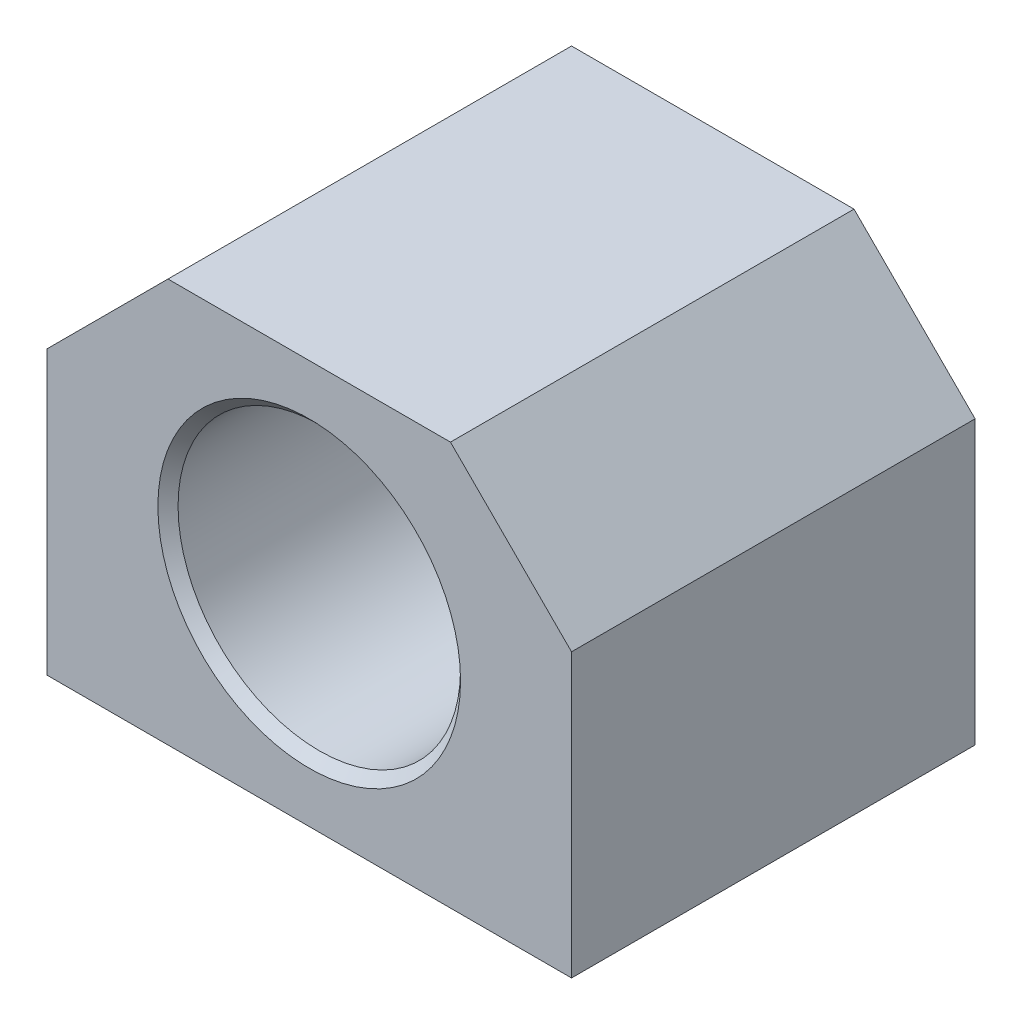
ISO-10303-21;
HEADER;
FILE_DESCRIPTION(('STEP AP214'),'2;1');
FILE_NAME('part.step','',(''),(''),'','','');
FILE_SCHEMA(('AUTOMOTIVE_DESIGN { 1 0 10303 214 1 1 1 1 }'));
ENDSEC;
DATA;
#1=APPLICATION_CONTEXT('core data for automotive mechanical design processes');
#2=APPLICATION_PROTOCOL_DEFINITION('international standard','automotive_design',2000,#1);
#3=PRODUCT_CONTEXT('',#1,'mechanical');
#4=PRODUCT('Part','Part','',(#3));
#5=PRODUCT_RELATED_PRODUCT_CATEGORY('part','',(#4));
#6=PRODUCT_DEFINITION_FORMATION('','',#4);
#7=PRODUCT_DEFINITION_CONTEXT('part definition',#1,'design');
#8=PRODUCT_DEFINITION('design','',#6,#7);
#9=PRODUCT_DEFINITION_SHAPE('','',#8);
#10=(LENGTH_UNIT() NAMED_UNIT(*) SI_UNIT(.MILLI.,.METRE.));
#11=(NAMED_UNIT(*) PLANE_ANGLE_UNIT() SI_UNIT($,.RADIAN.));
#12=(NAMED_UNIT(*) SI_UNIT($,.STERADIAN.) SOLID_ANGLE_UNIT());
#13=UNCERTAINTY_MEASURE_WITH_UNIT(LENGTH_MEASURE(1.E-05),#10,'distance_accuracy_value','');
#14=(GEOMETRIC_REPRESENTATION_CONTEXT(3) GLOBAL_UNCERTAINTY_ASSIGNED_CONTEXT((#13)) GLOBAL_UNIT_ASSIGNED_CONTEXT((#10,
#11,#12)) REPRESENTATION_CONTEXT('',''));
#15=CARTESIAN_POINT('',(0.,0.,0.));
#16=DIRECTION('',(0.,0.,1.));
#17=DIRECTION('',(1.,0.,0.));
#18=AXIS2_PLACEMENT_3D('',#15,#16,#17);
#19=CARTESIAN_POINT('',(14.103692308,-18.722756464,8.));
#20=DIRECTION('',(0.,-1.,0.));
#21=DIRECTION('',(0.,0.,-1.));
#22=AXIS2_PLACEMENT_3D('',#19,#20,#21);
#23=CONICAL_SURFACE('',#22,0.,0.785398163397448);
#24=CARTESIAN_POINT('',(14.103692308,-18.722756464,8.));
#25=VERTEX_POINT('',#24);
#26=VERTEX_LOOP('',#25);
#27=FACE_BOUND('',#26,.T.);
#28=CARTESIAN_POINT('',(14.103692308,-20.8227564635711,8.));
#29=DIRECTION('',(0.,-1.,0.));
#30=DIRECTION('',(0.,0.,-1.));
#31=AXIS2_PLACEMENT_3D('',#28,#29,#30);
#32=CIRCLE('',#31,2.1);
#33=CARTESIAN_POINT('',(14.103692308,-20.8227564635711,5.9));
#34=VERTEX_POINT('',#33);
#35=EDGE_CURVE('E103',#34,#34,#32,.F.);
#36=ORIENTED_EDGE('',*,*,#35,.F.);
#37=EDGE_LOOP('',(#36));
#38=FACE_BOUND('',#37,.T.);
#39=ADVANCED_FACE('F17',(#27,#38),#23,.F.);
#40=CARTESIAN_POINT('',(14.103692308,-18.722756464,32.));
#41=DIRECTION('',(0.,-1.,0.));
#42=DIRECTION('',(0.,0.,-1.));
#43=AXIS2_PLACEMENT_3D('',#40,#41,#42);
#44=CONICAL_SURFACE('',#43,0.,0.785398163397448);
#45=CARTESIAN_POINT('',(14.103692308,-18.722756464,32.));
#46=VERTEX_POINT('',#45);
#47=VERTEX_LOOP('',#46);
#48=FACE_BOUND('',#47,.T.);
#49=CARTESIAN_POINT('',(14.103692308,-20.8227564635711,32.));
#50=DIRECTION('',(0.,-1.,0.));
#51=DIRECTION('',(0.,0.,-1.));
#52=AXIS2_PLACEMENT_3D('',#49,#50,#51);
#53=CIRCLE('',#52,2.1);
#54=CARTESIAN_POINT('',(14.103692308,-20.8227564635711,29.9));
#55=VERTEX_POINT('',#54);
#56=EDGE_CURVE('E106',#55,#55,#53,.F.);
#57=ORIENTED_EDGE('',*,*,#56,.F.);
#58=EDGE_LOOP('',(#57));
#59=FACE_BOUND('',#58,.T.);
#60=ADVANCED_FACE('F100',(#48,#59),#44,.F.);
#61=CARTESIAN_POINT('',(-25.896307692,-18.722756464,32.));
#62=DIRECTION('',(0.,-1.,0.));
#63=DIRECTION('',(0.,0.,-1.));
#64=AXIS2_PLACEMENT_3D('',#61,#62,#63);
#65=CONICAL_SURFACE('',#64,0.,0.785398163397448);
#66=CARTESIAN_POINT('',(-25.896307692,-18.722756464,32.));
#67=VERTEX_POINT('',#66);
#68=VERTEX_LOOP('',#67);
#69=FACE_BOUND('',#68,.T.);
#70=CARTESIAN_POINT('',(-25.896307692,-20.8227564635711,32.));
#71=DIRECTION('',(0.,-1.,0.));
#72=DIRECTION('',(0.,0.,-1.));
#73=AXIS2_PLACEMENT_3D('',#70,#71,#72);
#74=CIRCLE('',#73,2.1);
#75=CARTESIAN_POINT('',(-25.896307692,-20.8227564635711,29.9));
#76=VERTEX_POINT('',#75);
#77=EDGE_CURVE('E111',#76,#76,#74,.F.);
#78=ORIENTED_EDGE('',*,*,#77,.F.);
#79=EDGE_LOOP('',(#78));
#80=FACE_BOUND('',#79,.T.);
#81=ADVANCED_FACE('F255',(#69,#80),#65,.F.);
#82=CARTESIAN_POINT('',(-25.896307692,-18.722756464,8.));
#83=DIRECTION('',(0.,-1.,0.));
#84=DIRECTION('',(0.,0.,-1.));
#85=AXIS2_PLACEMENT_3D('',#82,#83,#84);
#86=CONICAL_SURFACE('',#85,0.,0.785398163397448);
#87=CARTESIAN_POINT('',(-25.896307692,-18.722756464,8.));
#88=VERTEX_POINT('',#87);
#89=VERTEX_LOOP('',#88);
#90=FACE_BOUND('',#89,.T.);
#91=CARTESIAN_POINT('',(-25.896307692,-20.8227564635711,8.));
#92=DIRECTION('',(0.,-1.,0.));
#93=DIRECTION('',(0.,0.,-1.));
#94=AXIS2_PLACEMENT_3D('',#91,#92,#93);
#95=CIRCLE('',#94,2.1);
#96=CARTESIAN_POINT('',(-25.896307692,-20.8227564635711,5.9));
#97=VERTEX_POINT('',#96);
#98=EDGE_CURVE('E246',#97,#97,#95,.F.);
#99=ORIENTED_EDGE('',*,*,#98,.F.);
#100=EDGE_LOOP('',(#99));
#101=FACE_BOUND('',#100,.T.);
#102=ADVANCED_FACE('F257',(#90,#101),#86,.F.);
#103=CARTESIAN_POINT('',(14.103692308,-20.822756464,8.));
#104=DIRECTION('',(0.,-1.,0.));
#105=DIRECTION('',(0.,0.,-1.));
#106=AXIS2_PLACEMENT_3D('',#103,#104,#105);
#107=CYLINDRICAL_SURFACE('',#106,2.1);
#108=CARTESIAN_POINT('',(14.103692308,-32.3977564635746,8.));
#109=DIRECTION('',(0.,-1.,0.));
#110=DIRECTION('',(0.,0.,-1.));
#111=AXIS2_PLACEMENT_3D('',#108,#109,#110);
#112=CIRCLE('',#111,2.09999999957459);
#113=CARTESIAN_POINT('',(14.103692308,-32.3977564635746,5.90000000042541));
#114=VERTEX_POINT('',#113);
#115=EDGE_CURVE('E242',#114,#114,#112,.F.);
#116=ORIENTED_EDGE('',*,*,#115,.F.);
#117=EDGE_LOOP('',(#116));
#118=FACE_BOUND('',#117,.T.);
#119=ORIENTED_EDGE('',*,*,#35,.T.);
#120=EDGE_LOOP('',(#119));
#121=FACE_BOUND('',#120,.T.);
#122=ADVANCED_FACE('F265',(#118,#121),#107,.F.);
#123=CARTESIAN_POINT('',(14.103692308,-20.822756464,32.));
#124=DIRECTION('',(0.,-1.,0.));
#125=DIRECTION('',(0.,0.,-1.));
#126=AXIS2_PLACEMENT_3D('',#123,#124,#125);
#127=CYLINDRICAL_SURFACE('',#126,2.1);
#128=CARTESIAN_POINT('',(14.103692308,-32.3977564635746,32.));
#129=DIRECTION('',(0.,-1.,0.));
#130=DIRECTION('',(0.,0.,-1.));
#131=AXIS2_PLACEMENT_3D('',#128,#129,#130);
#132=CIRCLE('',#131,2.09999999957461);
#133=CARTESIAN_POINT('',(14.103692308,-32.3977564635746,29.9000000004254));
#134=VERTEX_POINT('',#133);
#135=EDGE_CURVE('E238',#134,#134,#132,.F.);
#136=ORIENTED_EDGE('',*,*,#135,.F.);
#137=EDGE_LOOP('',(#136));
#138=FACE_BOUND('',#137,.T.);
#139=ORIENTED_EDGE('',*,*,#56,.T.);
#140=EDGE_LOOP('',(#139));
#141=FACE_BOUND('',#140,.T.);
#142=ADVANCED_FACE('F409',(#138,#141),#127,.F.);
#143=CARTESIAN_POINT('',(-25.896307692,-20.822756464,32.));
#144=DIRECTION('',(0.,-1.,0.));
#145=DIRECTION('',(0.,0.,-1.));
#146=AXIS2_PLACEMENT_3D('',#143,#144,#145);
#147=CYLINDRICAL_SURFACE('',#146,2.1);
#148=CARTESIAN_POINT('',(-25.896307692,-32.3977564635746,32.));
#149=DIRECTION('',(0.,-1.,0.));
#150=DIRECTION('',(0.,0.,-1.));
#151=AXIS2_PLACEMENT_3D('',#148,#149,#150);
#152=CIRCLE('',#151,2.09999999957461);
#153=CARTESIAN_POINT('',(-25.896307692,-32.3977564635746,29.9000000004254));
#154=VERTEX_POINT('',#153);
#155=EDGE_CURVE('E234',#154,#154,#152,.F.);
#156=ORIENTED_EDGE('',*,*,#155,.F.);
#157=EDGE_LOOP('',(#156));
#158=FACE_BOUND('',#157,.T.);
#159=ORIENTED_EDGE('',*,*,#77,.T.);
#160=EDGE_LOOP('',(#159));
#161=FACE_BOUND('',#160,.T.);
#162=ADVANCED_FACE('F253',(#158,#161),#147,.F.);
#163=CARTESIAN_POINT('',(-25.896307692,-20.822756464,8.));
#164=DIRECTION('',(0.,-1.,0.));
#165=DIRECTION('',(0.,0.,-1.));
#166=AXIS2_PLACEMENT_3D('',#163,#164,#165);
#167=CYLINDRICAL_SURFACE('',#166,2.1);
#168=CARTESIAN_POINT('',(-25.896307692,-32.3977564635746,8.));
#169=DIRECTION('',(0.,-1.,0.));
#170=DIRECTION('',(0.,0.,-1.));
#171=AXIS2_PLACEMENT_3D('',#168,#169,#170);
#172=CIRCLE('',#171,2.09999999957461);
#173=CARTESIAN_POINT('',(-25.896307692,-32.3977564635746,5.90000000042539));
#174=VERTEX_POINT('',#173);
#175=EDGE_CURVE('E230',#174,#174,#172,.F.);
#176=ORIENTED_EDGE('',*,*,#175,.F.);
#177=EDGE_LOOP('',(#176));
#178=FACE_BOUND('',#177,.T.);
#179=ORIENTED_EDGE('',*,*,#98,.T.);
#180=EDGE_LOOP('',(#179));
#181=FACE_BOUND('',#180,.T.);
#182=ADVANCED_FACE('F402',(#178,#181),#167,.F.);
#183=CARTESIAN_POINT('',(-24.896307692,-12.822756464,12.1));
#184=DIRECTION('',(0.,0.,-1.));
#185=DIRECTION('',(0.,1.,0.));
#186=AXIS2_PLACEMENT_3D('',#183,#184,#185);
#187=CONICAL_SURFACE('',#186,0.,0.785398163397448);
#188=CARTESIAN_POINT('',(-24.896307692,-12.822756464,12.1));
#189=VERTEX_POINT('',#188);
#190=VERTEX_LOOP('',#189);
#191=FACE_BOUND('',#190,.T.);
#192=CARTESIAN_POINT('',(-24.896307692,-12.822756464,10.));
#193=DIRECTION('',(0.,0.,-1.));
#194=DIRECTION('',(-1.,0.,0.));
#195=AXIS2_PLACEMENT_3D('',#192,#193,#194);
#196=CIRCLE('',#195,2.1);
#197=CARTESIAN_POINT('',(-26.996307692,-12.822756464,10.));
#198=VERTEX_POINT('',#197);
#199=EDGE_CURVE('E226',#198,#198,#196,.F.);
#200=ORIENTED_EDGE('',*,*,#199,.F.);
#201=EDGE_LOOP('',(#200));
#202=FACE_BOUND('',#201,.T.);
#203=ADVANCED_FACE('F398',(#191,#202),#187,.F.);
#204=CARTESIAN_POINT('',(-19.331336535,-26.257785306,12.1));
#205=DIRECTION('',(0.,0.,-1.));
#206=DIRECTION('',(0.,1.,0.));
#207=AXIS2_PLACEMENT_3D('',#204,#205,#206);
#208=CONICAL_SURFACE('',#207,0.,0.785398163397448);
#209=CARTESIAN_POINT('',(-19.331336535,-26.257785306,12.1));
#210=VERTEX_POINT('',#209);
#211=VERTEX_LOOP('',#210);
#212=FACE_BOUND('',#211,.T.);
#213=CARTESIAN_POINT('',(-19.331336535,-26.257785306,10.));
#214=DIRECTION('',(0.,0.,-1.));
#215=DIRECTION('',(-1.,0.,0.));
#216=AXIS2_PLACEMENT_3D('',#213,#214,#215);
#217=CIRCLE('',#216,2.1);
#218=CARTESIAN_POINT('',(-21.431336535,-26.257785306,10.));
#219=VERTEX_POINT('',#218);
#220=EDGE_CURVE('E222',#219,#219,#217,.F.);
#221=ORIENTED_EDGE('',*,*,#220,.F.);
#222=EDGE_LOOP('',(#221));
#223=FACE_BOUND('',#222,.T.);
#224=ADVANCED_FACE('F394',(#212,#223),#208,.F.);
#225=CARTESIAN_POINT('',(7.53872115,-26.257785306,12.1));
#226=DIRECTION('',(0.,0.,-1.));
#227=DIRECTION('',(0.,1.,0.));
#228=AXIS2_PLACEMENT_3D('',#225,#226,#227);
#229=CONICAL_SURFACE('',#228,0.,0.785398163397449);
#230=CARTESIAN_POINT('',(7.53872115,-26.257785306,12.1));
#231=VERTEX_POINT('',#230);
#232=VERTEX_LOOP('',#231);
#233=FACE_BOUND('',#232,.T.);
#234=CARTESIAN_POINT('',(7.53872115,-26.257785306,10.));
#235=DIRECTION('',(0.,0.,-1.));
#236=DIRECTION('',(-1.,0.,0.));
#237=AXIS2_PLACEMENT_3D('',#234,#235,#236);
#238=CIRCLE('',#237,2.1);
#239=CARTESIAN_POINT('',(5.43872115,-26.257785306,10.));
#240=VERTEX_POINT('',#239);
#241=EDGE_CURVE('E218',#240,#240,#238,.F.);
#242=ORIENTED_EDGE('',*,*,#241,.F.);
#243=EDGE_LOOP('',(#242));
#244=FACE_BOUND('',#243,.T.);
#245=ADVANCED_FACE('F390',(#233,#244),#229,.F.);
#246=CARTESIAN_POINT('',(13.103692308,-12.822756464,12.1));
#247=DIRECTION('',(0.,0.,-1.));
#248=DIRECTION('',(0.,1.,0.));
#249=AXIS2_PLACEMENT_3D('',#246,#247,#248);
#250=CONICAL_SURFACE('',#249,0.,0.785398163397448);
#251=CARTESIAN_POINT('',(13.103692308,-12.822756464,12.1));
#252=VERTEX_POINT('',#251);
#253=VERTEX_LOOP('',#252);
#254=FACE_BOUND('',#253,.T.);
#255=CARTESIAN_POINT('',(13.103692308,-12.822756464,10.));
#256=DIRECTION('',(0.,0.,-1.));
#257=DIRECTION('',(-1.,0.,0.));
#258=AXIS2_PLACEMENT_3D('',#255,#256,#257);
#259=CIRCLE('',#258,2.1);
#260=CARTESIAN_POINT('',(11.003692308,-12.822756464,10.));
#261=VERTEX_POINT('',#260);
#262=EDGE_CURVE('E214',#261,#261,#259,.F.);
#263=ORIENTED_EDGE('',*,*,#262,.F.);
#264=EDGE_LOOP('',(#263));
#265=FACE_BOUND('',#264,.T.);
#266=ADVANCED_FACE('F386',(#254,#265),#250,.F.);
#267=CARTESIAN_POINT('',(-19.331336535,0.612272379,12.1));
#268=DIRECTION('',(0.,0.,-1.));
#269=DIRECTION('',(0.,1.,0.));
#270=AXIS2_PLACEMENT_3D('',#267,#268,#269);
#271=CONICAL_SURFACE('',#270,0.,0.785398163397448);
#272=CARTESIAN_POINT('',(-19.331336535,0.612272379,12.1));
#273=VERTEX_POINT('',#272);
#274=VERTEX_LOOP('',#273);
#275=FACE_BOUND('',#274,.T.);
#276=CARTESIAN_POINT('',(-19.331336535,0.612272379,10.));
#277=DIRECTION('',(0.,0.,-1.));
#278=DIRECTION('',(-1.,0.,0.));
#279=AXIS2_PLACEMENT_3D('',#276,#277,#278);
#280=CIRCLE('',#279,2.1);
#281=CARTESIAN_POINT('',(-21.431336535,0.612272379,10.));
#282=VERTEX_POINT('',#281);
#283=EDGE_CURVE('E210',#282,#282,#280,.F.);
#284=ORIENTED_EDGE('',*,*,#283,.F.);
#285=EDGE_LOOP('',(#284));
#286=FACE_BOUND('',#285,.T.);
#287=ADVANCED_FACE('F382',(#275,#286),#271,.F.);
#288=CARTESIAN_POINT('',(7.53872115,0.612272379,12.1));
#289=DIRECTION('',(0.,0.,-1.));
#290=DIRECTION('',(0.,1.,0.));
#291=AXIS2_PLACEMENT_3D('',#288,#289,#290);
#292=CONICAL_SURFACE('',#291,0.,0.785398163397449);
#293=CARTESIAN_POINT('',(7.53872115,0.612272379,12.1));
#294=VERTEX_POINT('',#293);
#295=VERTEX_LOOP('',#294);
#296=FACE_BOUND('',#295,.T.);
#297=CARTESIAN_POINT('',(7.53872115,0.612272379,10.));
#298=DIRECTION('',(0.,0.,-1.));
#299=DIRECTION('',(-1.,0.,0.));
#300=AXIS2_PLACEMENT_3D('',#297,#298,#299);
#301=CIRCLE('',#300,2.1);
#302=CARTESIAN_POINT('',(5.43872115,0.612272379,10.));
#303=VERTEX_POINT('',#302);
#304=EDGE_CURVE('E206',#303,#303,#301,.F.);
#305=ORIENTED_EDGE('',*,*,#304,.F.);
#306=EDGE_LOOP('',(#305));
#307=FACE_BOUND('',#306,.T.);
#308=ADVANCED_FACE('F378',(#296,#307),#292,.F.);
#309=CARTESIAN_POINT('',(14.103692308,-32.397756464,8.));
#310=DIRECTION('',(0.,-1.,0.));
#311=DIRECTION('',(0.,0.,-1.));
#312=AXIS2_PLACEMENT_3D('',#309,#310,#311);
#313=CONICAL_SURFACE('',#312,2.1,0.785398163397446);
#314=CARTESIAN_POINT('',(14.103692308,-32.8227564639999,8.));
#315=DIRECTION('',(0.,-1.,0.));
#316=DIRECTION('',(0.,0.,-1.));
#317=AXIS2_PLACEMENT_3D('',#314,#315,#316);
#318=CIRCLE('',#317,2.5249999999999);
#319=CARTESIAN_POINT('',(14.103692308,-32.8227564639999,5.4750000000001));
#320=VERTEX_POINT('',#319);
#321=EDGE_CURVE('E152',#320,#320,#318,.F.);
#322=ORIENTED_EDGE('',*,*,#321,.F.);
#323=EDGE_LOOP('',(#322));
#324=FACE_BOUND('',#323,.T.);
#325=ORIENTED_EDGE('',*,*,#115,.T.);
#326=EDGE_LOOP('',(#325));
#327=FACE_BOUND('',#326,.T.);
#328=ADVANCED_FACE('F374',(#324,#327),#313,.F.);
#329=CARTESIAN_POINT('',(14.103692308,-32.397756464,32.));
#330=DIRECTION('',(0.,-1.,0.));
#331=DIRECTION('',(0.,0.,-1.));
#332=AXIS2_PLACEMENT_3D('',#329,#330,#331);
#333=CONICAL_SURFACE('',#332,2.1,0.785398163397448);
#334=CARTESIAN_POINT('',(14.103692308,-32.8227564639999,32.));
#335=DIRECTION('',(0.,-1.,0.));
#336=DIRECTION('',(0.,0.,-1.));
#337=AXIS2_PLACEMENT_3D('',#334,#335,#336);
#338=CIRCLE('',#337,2.52499999999991);
#339=CARTESIAN_POINT('',(14.103692308,-32.8227564639999,29.4750000000001));
#340=VERTEX_POINT('',#339);
#341=EDGE_CURVE('E149',#340,#340,#338,.F.);
#342=ORIENTED_EDGE('',*,*,#341,.F.);
#343=EDGE_LOOP('',(#342));
#344=FACE_BOUND('',#343,.T.);
#345=ORIENTED_EDGE('',*,*,#135,.T.);
#346=EDGE_LOOP('',(#345));
#347=FACE_BOUND('',#346,.T.);
#348=ADVANCED_FACE('F370',(#344,#347),#333,.F.);
#349=CARTESIAN_POINT('',(-25.896307692,-32.397756464,32.));
#350=DIRECTION('',(0.,-1.,0.));
#351=DIRECTION('',(0.,0.,-1.));
#352=AXIS2_PLACEMENT_3D('',#349,#350,#351);
#353=CONICAL_SURFACE('',#352,2.1,0.785398163397448);
#354=CARTESIAN_POINT('',(-25.896307692,-32.8227564639999,32.));
#355=DIRECTION('',(0.,-1.,0.));
#356=DIRECTION('',(0.,0.,-1.));
#357=AXIS2_PLACEMENT_3D('',#354,#355,#356);
#358=CIRCLE('',#357,2.52499999999991);
#359=CARTESIAN_POINT('',(-25.896307692,-32.8227564639999,29.4750000000001));
#360=VERTEX_POINT('',#359);
#361=EDGE_CURVE('E145',#360,#360,#358,.F.);
#362=ORIENTED_EDGE('',*,*,#361,.F.);
#363=EDGE_LOOP('',(#362));
#364=FACE_BOUND('',#363,.T.);
#365=ORIENTED_EDGE('',*,*,#155,.T.);
#366=EDGE_LOOP('',(#365));
#367=FACE_BOUND('',#366,.T.);
#368=ADVANCED_FACE('F366',(#364,#367),#353,.F.);
#369=CARTESIAN_POINT('',(-25.896307692,-32.397756464,8.));
#370=DIRECTION('',(0.,-1.,0.));
#371=DIRECTION('',(0.,0.,-1.));
#372=AXIS2_PLACEMENT_3D('',#369,#370,#371);
#373=CONICAL_SURFACE('',#372,2.1,0.785398163397446);
#374=CARTESIAN_POINT('',(-25.896307692,-32.8227564639999,8.));
#375=DIRECTION('',(0.,-1.,0.));
#376=DIRECTION('',(0.,0.,-1.));
#377=AXIS2_PLACEMENT_3D('',#374,#375,#376);
#378=CIRCLE('',#377,2.5249999999999);
#379=CARTESIAN_POINT('',(-25.896307692,-32.8227564639999,5.4750000000001));
#380=VERTEX_POINT('',#379);
#381=EDGE_CURVE('E140',#380,#380,#378,.F.);
#382=ORIENTED_EDGE('',*,*,#381,.F.);
#383=EDGE_LOOP('',(#382));
#384=FACE_BOUND('',#383,.T.);
#385=ORIENTED_EDGE('',*,*,#175,.T.);
#386=EDGE_LOOP('',(#385));
#387=FACE_BOUND('',#386,.T.);
#388=ADVANCED_FACE('F362',(#384,#387),#373,.F.);
#389=CARTESIAN_POINT('',(0.,0.,40.));
#390=DIRECTION('',(0.,0.,1.));
#391=DIRECTION('',(1.,0.,0.));
#392=AXIS2_PLACEMENT_3D('',#389,#390,#391);
#393=PLANE('',#392);
#394=CARTESIAN_POINT('',(-5.896307692,-12.822756464,39.9999999999999));
#395=DIRECTION('',(0.,0.,1.));
#396=DIRECTION('',(1.,0.,0.));
#397=AXIS2_PLACEMENT_3D('',#394,#395,#396);
#398=CIRCLE('',#397,14.9999999999999);
#399=CARTESIAN_POINT('',(9.10369230799992,-12.822756464,39.9999999999999));
#400=VERTEX_POINT('',#399);
#401=EDGE_CURVE('E20',#400,#400,#398,.T.);
#402=ORIENTED_EDGE('',*,*,#401,.F.);
#403=EDGE_LOOP('',(#402));
#404=FACE_BOUND('',#403,.T.);
#405=DIRECTION('',(0.,1.,0.));
#406=VECTOR('',#405,1.);
#407=CARTESIAN_POINT('',(-31.896307692,-4.822756464,40.));
#408=LINE('',#407,#406);
#409=CARTESIAN_POINT('',(-31.896307692,-32.822756464,40.));
#410=VERTEX_POINT('',#409);
#411=CARTESIAN_POINT('',(-31.896307692,-4.822756464,40.));
#412=VERTEX_POINT('',#411);
#413=EDGE_CURVE('E706',#410,#412,#408,.T.);
#414=ORIENTED_EDGE('',*,*,#413,.F.);
#415=DIRECTION('',(1.,0.,0.));
#416=VECTOR('',#415,1.);
#417=CARTESIAN_POINT('',(-31.896307692,-32.822756464,40.));
#418=LINE('',#417,#416);
#419=CARTESIAN_POINT('',(20.103692308,-32.822756464,40.));
#420=VERTEX_POINT('',#419);
#421=EDGE_CURVE('E155',#420,#410,#418,.F.);
#422=ORIENTED_EDGE('',*,*,#421,.F.);
#423=DIRECTION('',(0.,1.,0.));
#424=VECTOR('',#423,1.);
#425=CARTESIAN_POINT('',(20.103692308,-4.822756464,40.));
#426=LINE('',#425,#424);
#427=CARTESIAN_POINT('',(20.103692308,-4.822756464,40.));
#428=VERTEX_POINT('',#427);
#429=EDGE_CURVE('E166',#428,#420,#426,.F.);
#430=ORIENTED_EDGE('',*,*,#429,.F.);
#431=DIRECTION('',(0.707106781186548,-0.707106781186548,0.));
#432=VECTOR('',#431,1.);
#433=CARTESIAN_POINT('',(8.103692308,7.177243536,40.));
#434=LINE('',#433,#432);
#435=CARTESIAN_POINT('',(8.103692308,7.177243536,40.));
#436=VERTEX_POINT('',#435);
#437=EDGE_CURVE('E734',#436,#428,#434,.T.);
#438=ORIENTED_EDGE('',*,*,#437,.F.);
#439=DIRECTION('',(1.,0.,0.));
#440=VECTOR('',#439,1.);
#441=CARTESIAN_POINT('',(-19.896307692,7.177243536,40.));
#442=LINE('',#441,#440);
#443=CARTESIAN_POINT('',(-19.896307692,7.177243536,40.));
#444=VERTEX_POINT('',#443);
#445=EDGE_CURVE('E729',#444,#436,#442,.T.);
#446=ORIENTED_EDGE('',*,*,#445,.F.);
#447=DIRECTION('',(0.707106781186548,0.707106781186548,0.));
#448=VECTOR('',#447,1.);
#449=CARTESIAN_POINT('',(-31.896307692,-4.822756464,40.));
#450=LINE('',#449,#448);
#451=EDGE_CURVE('E709',#412,#444,#450,.T.);
#452=ORIENTED_EDGE('',*,*,#451,.F.);
#453=EDGE_LOOP('',(#414,#422,#430,#438,#446,#452));
#454=FACE_BOUND('',#453,.T.);
#455=ADVANCED_FACE('F358',(#404,#454),#393,.T.);
#456=CARTESIAN_POINT('',(-24.896307692,-12.822756464,10.));
#457=DIRECTION('',(0.,0.,-1.));
#458=DIRECTION('',(0.,1.,0.));
#459=AXIS2_PLACEMENT_3D('',#456,#457,#458);
#460=CYLINDRICAL_SURFACE('',#459,2.1);
#461=CARTESIAN_POINT('',(-24.896307692,-12.822756464,0.650000000000039));
#462=DIRECTION('',(0.,0.,-1.));
#463=DIRECTION('',(-1.,0.,0.));
#464=AXIS2_PLACEMENT_3D('',#461,#462,#463);
#465=CIRCLE('',#464,2.1);
#466=CARTESIAN_POINT('',(-26.996307692,-12.822756464,0.65));
#467=VERTEX_POINT('',#466);
#468=EDGE_CURVE('E194',#467,#467,#465,.F.);
#469=ORIENTED_EDGE('',*,*,#468,.F.);
#470=EDGE_LOOP('',(#469));
#471=FACE_BOUND('',#470,.T.);
#472=ORIENTED_EDGE('',*,*,#199,.T.);
#473=EDGE_LOOP('',(#472));
#474=FACE_BOUND('',#473,.T.);
#475=ADVANCED_FACE('F354',(#471,#474),#460,.F.);
#476=CARTESIAN_POINT('',(-19.331336535,-26.257785306,10.));
#477=DIRECTION('',(0.,0.,-1.));
#478=DIRECTION('',(0.,1.,0.));
#479=AXIS2_PLACEMENT_3D('',#476,#477,#478);
#480=CYLINDRICAL_SURFACE('',#479,2.1);
#481=CARTESIAN_POINT('',(-19.331336535,-26.257785306,0.650000000000039));
#482=DIRECTION('',(0.,0.,-1.));
#483=DIRECTION('',(-1.,0.,0.));
#484=AXIS2_PLACEMENT_3D('',#481,#482,#483);
#485=CIRCLE('',#484,2.1);
#486=CARTESIAN_POINT('',(-21.431336535,-26.257785306,0.65));
#487=VERTEX_POINT('',#486);
#488=EDGE_CURVE('E190',#487,#487,#485,.F.);
#489=ORIENTED_EDGE('',*,*,#488,.F.);
#490=EDGE_LOOP('',(#489));
#491=FACE_BOUND('',#490,.T.);
#492=ORIENTED_EDGE('',*,*,#220,.T.);
#493=EDGE_LOOP('',(#492));
#494=FACE_BOUND('',#493,.T.);
#495=ADVANCED_FACE('F350',(#491,#494),#480,.F.);
#496=CARTESIAN_POINT('',(7.53872115,-26.257785306,10.));
#497=DIRECTION('',(0.,0.,-1.));
#498=DIRECTION('',(0.,1.,0.));
#499=AXIS2_PLACEMENT_3D('',#496,#497,#498);
#500=CYLINDRICAL_SURFACE('',#499,2.1);
#501=CARTESIAN_POINT('',(7.53872115,-26.257785306,0.650000000000039));
#502=DIRECTION('',(0.,0.,-1.));
#503=DIRECTION('',(-1.,0.,0.));
#504=AXIS2_PLACEMENT_3D('',#501,#502,#503);
#505=CIRCLE('',#504,2.1);
#506=CARTESIAN_POINT('',(5.43872115,-26.257785306,0.65));
#507=VERTEX_POINT('',#506);
#508=EDGE_CURVE('E186',#507,#507,#505,.F.);
#509=ORIENTED_EDGE('',*,*,#508,.F.);
#510=EDGE_LOOP('',(#509));
#511=FACE_BOUND('',#510,.T.);
#512=ORIENTED_EDGE('',*,*,#241,.T.);
#513=EDGE_LOOP('',(#512));
#514=FACE_BOUND('',#513,.T.);
#515=ADVANCED_FACE('F346',(#511,#514),#500,.F.);
#516=CARTESIAN_POINT('',(13.103692308,-12.822756464,10.));
#517=DIRECTION('',(0.,0.,-1.));
#518=DIRECTION('',(0.,1.,0.));
#519=AXIS2_PLACEMENT_3D('',#516,#517,#518);
#520=CYLINDRICAL_SURFACE('',#519,2.1);
#521=CARTESIAN_POINT('',(13.103692308,-12.822756464,0.650000000000039));
#522=DIRECTION('',(0.,0.,-1.));
#523=DIRECTION('',(-1.,0.,0.));
#524=AXIS2_PLACEMENT_3D('',#521,#522,#523);
#525=CIRCLE('',#524,2.1);
#526=CARTESIAN_POINT('',(11.003692308,-12.822756464,0.65));
#527=VERTEX_POINT('',#526);
#528=EDGE_CURVE('E182',#527,#527,#525,.F.);
#529=ORIENTED_EDGE('',*,*,#528,.F.);
#530=EDGE_LOOP('',(#529));
#531=FACE_BOUND('',#530,.T.);
#532=ORIENTED_EDGE('',*,*,#262,.T.);
#533=EDGE_LOOP('',(#532));
#534=FACE_BOUND('',#533,.T.);
#535=ADVANCED_FACE('F342',(#531,#534),#520,.F.);
#536=CARTESIAN_POINT('',(-19.331336535,0.612272379,10.));
#537=DIRECTION('',(0.,0.,-1.));
#538=DIRECTION('',(0.,1.,0.));
#539=AXIS2_PLACEMENT_3D('',#536,#537,#538);
#540=CYLINDRICAL_SURFACE('',#539,2.1);
#541=CARTESIAN_POINT('',(-19.331336535,0.612272379,0.650000000000039));
#542=DIRECTION('',(0.,0.,-1.));
#543=DIRECTION('',(-1.,0.,0.));
#544=AXIS2_PLACEMENT_3D('',#541,#542,#543);
#545=CIRCLE('',#544,2.1);
#546=CARTESIAN_POINT('',(-21.431336535,0.612272379,0.65));
#547=VERTEX_POINT('',#546);
#548=EDGE_CURVE('E178',#547,#547,#545,.F.);
#549=ORIENTED_EDGE('',*,*,#548,.F.);
#550=EDGE_LOOP('',(#549));
#551=FACE_BOUND('',#550,.T.);
#552=ORIENTED_EDGE('',*,*,#283,.T.);
#553=EDGE_LOOP('',(#552));
#554=FACE_BOUND('',#553,.T.);
#555=ADVANCED_FACE('F338',(#551,#554),#540,.F.);
#556=CARTESIAN_POINT('',(7.53872115,0.612272379,10.));
#557=DIRECTION('',(0.,0.,-1.));
#558=DIRECTION('',(0.,1.,0.));
#559=AXIS2_PLACEMENT_3D('',#556,#557,#558);
#560=CYLINDRICAL_SURFACE('',#559,2.1);
#561=CARTESIAN_POINT('',(7.53872115,0.612272379,0.650000000000039));
#562=DIRECTION('',(0.,0.,-1.));
#563=DIRECTION('',(-1.,0.,0.));
#564=AXIS2_PLACEMENT_3D('',#561,#562,#563);
#565=CIRCLE('',#564,2.1);
#566=CARTESIAN_POINT('',(5.43872115,0.612272379,0.65));
#567=VERTEX_POINT('',#566);
#568=EDGE_CURVE('E173',#567,#567,#565,.F.);
#569=ORIENTED_EDGE('',*,*,#568,.F.);
#570=EDGE_LOOP('',(#569));
#571=FACE_BOUND('',#570,.T.);
#572=ORIENTED_EDGE('',*,*,#304,.T.);
#573=EDGE_LOOP('',(#572));
#574=FACE_BOUND('',#573,.T.);
#575=ADVANCED_FACE('F334',(#571,#574),#560,.F.);
#576=CARTESIAN_POINT('',(-5.896307692,-12.822756464,39.));
#577=DIRECTION('',(0.,0.,1.));
#578=DIRECTION('',(1.,0.,0.));
#579=AXIS2_PLACEMENT_3D('',#576,#577,#578);
#580=CONICAL_SURFACE('',#579,14.,0.785398163397447);
#581=ORIENTED_EDGE('',*,*,#401,.T.);
#582=EDGE_LOOP('',(#581));
#583=FACE_BOUND('',#582,.T.);
#584=CARTESIAN_POINT('',(-5.896307692,-12.822756464,39.));
#585=DIRECTION('',(0.,0.,-1.));
#586=DIRECTION('',(-1.,0.,0.));
#587=AXIS2_PLACEMENT_3D('',#584,#585,#586);
#588=CIRCLE('',#587,14.);
#589=CARTESIAN_POINT('',(-19.896307692,-12.822756464,39.));
#590=VERTEX_POINT('',#589);
#591=EDGE_CURVE('E177',#590,#590,#588,.F.);
#592=ORIENTED_EDGE('',*,*,#591,.F.);
#593=EDGE_LOOP('',(#592));
#594=FACE_BOUND('',#593,.T.);
#595=ADVANCED_FACE('F330',(#583,#594),#580,.F.);
#596=CARTESIAN_POINT('',(20.103692308,-4.822756464,40.));
#597=DIRECTION('',(-1.,0.,0.));
#598=DIRECTION('',(0.,0.,1.));
#599=AXIS2_PLACEMENT_3D('',#596,#597,#598);
#600=PLANE('',#599);
#601=ORIENTED_EDGE('',*,*,#429,.T.);
#602=DIRECTION('',(0.,0.,1.));
#603=VECTOR('',#602,1.);
#604=CARTESIAN_POINT('',(20.103692308,-32.822756464,40.));
#605=LINE('',#604,#603);
#606=CARTESIAN_POINT('',(20.103692308,-32.822756464,0.));
#607=VERTEX_POINT('',#606);
#608=EDGE_CURVE('E159',#607,#420,#605,.T.);
#609=ORIENTED_EDGE('',*,*,#608,.F.);
#610=DIRECTION('',(0.,1.,0.));
#611=VECTOR('',#610,1.);
#612=CARTESIAN_POINT('',(20.103692308,0.,0.));
#613=LINE('',#612,#611);
#614=CARTESIAN_POINT('',(20.103692308,-4.822756464,0.));
#615=VERTEX_POINT('',#614);
#616=EDGE_CURVE('E205',#615,#607,#613,.F.);
#617=ORIENTED_EDGE('',*,*,#616,.F.);
#618=DIRECTION('',(0.,0.,1.));
#619=VECTOR('',#618,1.);
#620=CARTESIAN_POINT('',(20.103692308,-4.822756464,40.));
#621=LINE('',#620,#619);
#622=EDGE_CURVE('E198',#428,#615,#621,.F.);
#623=ORIENTED_EDGE('',*,*,#622,.F.);
#624=EDGE_LOOP('',(#601,#609,#617,#623));
#625=FACE_BOUND('',#624,.T.);
#626=ADVANCED_FACE('F326',(#625),#600,.F.);
#627=CARTESIAN_POINT('',(-31.896307692,-32.822756464,40.));
#628=DIRECTION('',(0.,1.,0.));
#629=DIRECTION('',(0.,0.,1.));
#630=AXIS2_PLACEMENT_3D('',#627,#628,#629);
#631=PLANE('',#630);
#632=ORIENTED_EDGE('',*,*,#381,.T.);
#633=EDGE_LOOP('',(#632));
#634=FACE_BOUND('',#633,.T.);
#635=ORIENTED_EDGE('',*,*,#361,.T.);
#636=EDGE_LOOP('',(#635));
#637=FACE_BOUND('',#636,.T.);
#638=ORIENTED_EDGE('',*,*,#341,.T.);
#639=EDGE_LOOP('',(#638));
#640=FACE_BOUND('',#639,.T.);
#641=ORIENTED_EDGE('',*,*,#321,.T.);
#642=EDGE_LOOP('',(#641));
#643=FACE_BOUND('',#642,.T.);
#644=ORIENTED_EDGE('',*,*,#421,.T.);
#645=DIRECTION('',(0.,0.,-1.));
#646=VECTOR('',#645,1.);
#647=CARTESIAN_POINT('',(-31.896307692,-32.822756464,40.));
#648=LINE('',#647,#646);
#649=CARTESIAN_POINT('',(-31.896307692,-32.822756464,0.));
#650=VERTEX_POINT('',#649);
#651=EDGE_CURVE('E144',#650,#410,#648,.F.);
#652=ORIENTED_EDGE('',*,*,#651,.F.);
#653=DIRECTION('',(1.,0.,0.));
#654=VECTOR('',#653,1.);
#655=CARTESIAN_POINT('',(0.,-32.822756464,0.));
#656=LINE('',#655,#654);
#657=EDGE_CURVE('E744',#607,#650,#656,.F.);
#658=ORIENTED_EDGE('',*,*,#657,.F.);
#659=ORIENTED_EDGE('',*,*,#608,.T.);
#660=EDGE_LOOP('',(#644,#652,#658,#659));
#661=FACE_BOUND('',#660,.T.);
#662=ADVANCED_FACE('F322',(#634,#637,#640,#643,#661),#631,.F.);
#663=CARTESIAN_POINT('',(-31.896307692,-4.822756464,40.));
#664=DIRECTION('',(1.,0.,0.));
#665=DIRECTION('',(0.,0.,-1.));
#666=AXIS2_PLACEMENT_3D('',#663,#664,#665);
#667=PLANE('',#666);
#668=ORIENTED_EDGE('',*,*,#413,.T.);
#669=DIRECTION('',(0.,0.,1.));
#670=VECTOR('',#669,1.);
#671=CARTESIAN_POINT('',(-31.896307692,-4.822756464,40.));
#672=LINE('',#671,#670);
#673=CARTESIAN_POINT('',(-31.896307692,-4.822756464,0.));
#674=VERTEX_POINT('',#673);
#675=EDGE_CURVE('E712',#674,#412,#672,.T.);
#676=ORIENTED_EDGE('',*,*,#675,.F.);
#677=DIRECTION('',(0.,1.,0.));
#678=VECTOR('',#677,1.);
#679=CARTESIAN_POINT('',(-31.896307692,0.,0.));
#680=LINE('',#679,#678);
#681=EDGE_CURVE('E715',#650,#674,#680,.T.);
#682=ORIENTED_EDGE('',*,*,#681,.F.);
#683=ORIENTED_EDGE('',*,*,#651,.T.);
#684=EDGE_LOOP('',(#668,#676,#682,#683));
#685=FACE_BOUND('',#684,.T.);
#686=ADVANCED_FACE('F318',(#685),#667,.F.);
#687=CARTESIAN_POINT('',(-31.896307692,-4.822756464,40.));
#688=DIRECTION('',(0.707106781186548,-0.707106781186548,0.));
#689=DIRECTION('',(0.707106781186548,0.707106781186548,0.));
#690=AXIS2_PLACEMENT_3D('',#687,#688,#689);
#691=PLANE('',#690);
#692=ORIENTED_EDGE('',*,*,#451,.T.);
#693=DIRECTION('',(0.,0.,-1.));
#694=VECTOR('',#693,1.);
#695=CARTESIAN_POINT('',(-19.896307692,7.177243536,40.));
#696=LINE('',#695,#694);
#697=CARTESIAN_POINT('',(-19.896307692,7.177243536,0.));
#698=VERTEX_POINT('',#697);
#699=EDGE_CURVE('E725',#698,#444,#696,.F.);
#700=ORIENTED_EDGE('',*,*,#699,.F.);
#701=DIRECTION('',(0.707106781186548,0.707106781186547,0.));
#702=VECTOR('',#701,1.);
#703=CARTESIAN_POINT('',(-31.896307692,-4.822756464,0.));
#704=LINE('',#703,#702);
#705=EDGE_CURVE('E749',#674,#698,#704,.T.);
#706=ORIENTED_EDGE('',*,*,#705,.F.);
#707=ORIENTED_EDGE('',*,*,#675,.T.);
#708=EDGE_LOOP('',(#692,#700,#706,#707));
#709=FACE_BOUND('',#708,.T.);
#710=ADVANCED_FACE('F315',(#709),#691,.F.);
#711=CARTESIAN_POINT('',(-19.896307692,7.177243536,40.));
#712=DIRECTION('',(0.,-1.,0.));
#713=DIRECTION('',(0.,0.,-1.));
#714=AXIS2_PLACEMENT_3D('',#711,#712,#713);
#715=PLANE('',#714);
#716=ORIENTED_EDGE('',*,*,#445,.T.);
#717=DIRECTION('',(0.,0.,1.));
#718=VECTOR('',#717,1.);
#719=CARTESIAN_POINT('',(8.103692308,7.177243536,40.));
#720=LINE('',#719,#718);
#721=CARTESIAN_POINT('',(8.103692308,7.177243536,0.));
#722=VERTEX_POINT('',#721);
#723=EDGE_CURVE('E36',#722,#436,#720,.T.);
#724=ORIENTED_EDGE('',*,*,#723,.F.);
#725=DIRECTION('',(1.,0.,0.));
#726=VECTOR('',#725,1.);
#727=CARTESIAN_POINT('',(0.,7.177243536,0.));
#728=LINE('',#727,#726);
#729=EDGE_CURVE('E753',#698,#722,#728,.T.);
#730=ORIENTED_EDGE('',*,*,#729,.F.);
#731=ORIENTED_EDGE('',*,*,#699,.T.);
#732=EDGE_LOOP('',(#716,#724,#730,#731));
#733=FACE_BOUND('',#732,.T.);
#734=ADVANCED_FACE('F311',(#733),#715,.F.);
#735=CARTESIAN_POINT('',(8.103692308,7.177243536,40.));
#736=DIRECTION('',(-0.707106781186548,-0.707106781186548,0.));
#737=DIRECTION('',(0.707106781186548,-0.707106781186548,0.));
#738=AXIS2_PLACEMENT_3D('',#735,#736,#737);
#739=PLANE('',#738);
#740=ORIENTED_EDGE('',*,*,#437,.T.);
#741=ORIENTED_EDGE('',*,*,#622,.T.);
#742=DIRECTION('',(0.707106781186547,-0.707106781186548,0.));
#743=VECTOR('',#742,1.);
#744=CARTESIAN_POINT('',(8.103692308,7.177243536,0.));
#745=LINE('',#744,#743);
#746=EDGE_CURVE('E139',#722,#615,#745,.T.);
#747=ORIENTED_EDGE('',*,*,#746,.F.);
#748=ORIENTED_EDGE('',*,*,#723,.T.);
#749=EDGE_LOOP('',(#740,#741,#747,#748));
#750=FACE_BOUND('',#749,.T.);
#751=ADVANCED_FACE('F307',(#750),#739,.F.);
#752=CARTESIAN_POINT('',(-24.896307692,-12.822756464,0.65));
#753=DIRECTION('',(0.,0.,-1.));
#754=DIRECTION('',(-1.,0.,0.));
#755=AXIS2_PLACEMENT_3D('',#752,#753,#754);
#756=CONICAL_SURFACE('',#755,2.1,0.785398163397449);
#757=CARTESIAN_POINT('',(-24.896307692,-12.822756464,0.));
#758=DIRECTION('',(0.,0.,-1.));
#759=DIRECTION('',(-1.,0.,0.));
#760=AXIS2_PLACEMENT_3D('',#757,#758,#759);
#761=CIRCLE('',#760,2.75);
#762=CARTESIAN_POINT('',(-27.646307692,-12.822756464,0.));
#763=VERTEX_POINT('',#762);
#764=EDGE_CURVE('E135',#763,#763,#761,.F.);
#765=ORIENTED_EDGE('',*,*,#764,.F.);
#766=EDGE_LOOP('',(#765));
#767=FACE_BOUND('',#766,.T.);
#768=ORIENTED_EDGE('',*,*,#468,.T.);
#769=EDGE_LOOP('',(#768));
#770=FACE_BOUND('',#769,.T.);
#771=ADVANCED_FACE('F303',(#767,#770),#756,.F.);
#772=CARTESIAN_POINT('',(-19.331336535,-26.257785306,0.65));
#773=DIRECTION('',(0.,0.,-1.));
#774=DIRECTION('',(-1.,0.,0.));
#775=AXIS2_PLACEMENT_3D('',#772,#773,#774);
#776=CONICAL_SURFACE('',#775,2.1,0.785398163397447);
#777=CARTESIAN_POINT('',(-19.331336535,-26.257785306,0.));
#778=DIRECTION('',(0.,0.,-1.));
#779=DIRECTION('',(-1.,0.,0.));
#780=AXIS2_PLACEMENT_3D('',#777,#778,#779);
#781=CIRCLE('',#780,2.75);
#782=CARTESIAN_POINT('',(-22.081336535,-26.257785306,0.));
#783=VERTEX_POINT('',#782);
#784=EDGE_CURVE('E131',#783,#783,#781,.F.);
#785=ORIENTED_EDGE('',*,*,#784,.F.);
#786=EDGE_LOOP('',(#785));
#787=FACE_BOUND('',#786,.T.);
#788=ORIENTED_EDGE('',*,*,#488,.T.);
#789=EDGE_LOOP('',(#788));
#790=FACE_BOUND('',#789,.T.);
#791=ADVANCED_FACE('F299',(#787,#790),#776,.F.);
#792=CARTESIAN_POINT('',(7.53872115,-26.257785306,0.65));
#793=DIRECTION('',(0.,0.,-1.));
#794=DIRECTION('',(-1.,0.,0.));
#795=AXIS2_PLACEMENT_3D('',#792,#793,#794);
#796=CONICAL_SURFACE('',#795,2.1,0.785398163397449);
#797=CARTESIAN_POINT('',(7.53872115,-26.257785306,0.));
#798=DIRECTION('',(0.,0.,-1.));
#799=DIRECTION('',(-1.,0.,0.));
#800=AXIS2_PLACEMENT_3D('',#797,#798,#799);
#801=CIRCLE('',#800,2.75);
#802=CARTESIAN_POINT('',(4.78872115,-26.257785306,0.));
#803=VERTEX_POINT('',#802);
#804=EDGE_CURVE('E127',#803,#803,#801,.F.);
#805=ORIENTED_EDGE('',*,*,#804,.F.);
#806=EDGE_LOOP('',(#805));
#807=FACE_BOUND('',#806,.T.);
#808=ORIENTED_EDGE('',*,*,#508,.T.);
#809=EDGE_LOOP('',(#808));
#810=FACE_BOUND('',#809,.T.);
#811=ADVANCED_FACE('F295',(#807,#810),#796,.F.);
#812=CARTESIAN_POINT('',(13.103692308,-12.822756464,0.65));
#813=DIRECTION('',(0.,0.,-1.));
#814=DIRECTION('',(-1.,0.,0.));
#815=AXIS2_PLACEMENT_3D('',#812,#813,#814);
#816=CONICAL_SURFACE('',#815,2.1,0.785398163397447);
#817=CARTESIAN_POINT('',(13.103692308,-12.822756464,0.));
#818=DIRECTION('',(0.,0.,-1.));
#819=DIRECTION('',(-1.,0.,0.));
#820=AXIS2_PLACEMENT_3D('',#817,#818,#819);
#821=CIRCLE('',#820,2.75);
#822=CARTESIAN_POINT('',(10.353692308,-12.822756464,0.));
#823=VERTEX_POINT('',#822);
#824=EDGE_CURVE('E123',#823,#823,#821,.F.);
#825=ORIENTED_EDGE('',*,*,#824,.F.);
#826=EDGE_LOOP('',(#825));
#827=FACE_BOUND('',#826,.T.);
#828=ORIENTED_EDGE('',*,*,#528,.T.);
#829=EDGE_LOOP('',(#828));
#830=FACE_BOUND('',#829,.T.);
#831=ADVANCED_FACE('F291',(#827,#830),#816,.F.);
#832=CARTESIAN_POINT('',(-19.331336535,0.612272379,0.65));
#833=DIRECTION('',(0.,0.,-1.));
#834=DIRECTION('',(-1.,0.,0.));
#835=AXIS2_PLACEMENT_3D('',#832,#833,#834);
#836=CONICAL_SURFACE('',#835,2.1,0.785398163397447);
#837=CARTESIAN_POINT('',(-19.331336535,0.612272379,0.));
#838=DIRECTION('',(0.,0.,-1.));
#839=DIRECTION('',(-1.,0.,0.));
#840=AXIS2_PLACEMENT_3D('',#837,#838,#839);
#841=CIRCLE('',#840,2.75);
#842=CARTESIAN_POINT('',(-22.081336535,0.612272379,0.));
#843=VERTEX_POINT('',#842);
#844=EDGE_CURVE('E119',#843,#843,#841,.F.);
#845=ORIENTED_EDGE('',*,*,#844,.F.);
#846=EDGE_LOOP('',(#845));
#847=FACE_BOUND('',#846,.T.);
#848=ORIENTED_EDGE('',*,*,#548,.T.);
#849=EDGE_LOOP('',(#848));
#850=FACE_BOUND('',#849,.T.);
#851=ADVANCED_FACE('F287',(#847,#850),#836,.F.);
#852=CARTESIAN_POINT('',(7.53872115,0.612272379,0.65));
#853=DIRECTION('',(0.,0.,-1.));
#854=DIRECTION('',(-1.,0.,0.));
#855=AXIS2_PLACEMENT_3D('',#852,#853,#854);
#856=CONICAL_SURFACE('',#855,2.1,0.785398163397449);
#857=CARTESIAN_POINT('',(7.53872115,0.612272379,0.));
#858=DIRECTION('',(0.,0.,-1.));
#859=DIRECTION('',(-1.,0.,0.));
#860=AXIS2_PLACEMENT_3D('',#857,#858,#859);
#861=CIRCLE('',#860,2.75);
#862=CARTESIAN_POINT('',(4.78872115,0.612272379,0.));
#863=VERTEX_POINT('',#862);
#864=EDGE_CURVE('E115',#863,#863,#861,.F.);
#865=ORIENTED_EDGE('',*,*,#864,.F.);
#866=EDGE_LOOP('',(#865));
#867=FACE_BOUND('',#866,.T.);
#868=ORIENTED_EDGE('',*,*,#568,.T.);
#869=EDGE_LOOP('',(#868));
#870=FACE_BOUND('',#869,.T.);
#871=ADVANCED_FACE('F283',(#867,#870),#856,.F.);
#872=CARTESIAN_POINT('',(-5.896307692,-12.822756464,39.));
#873=DIRECTION('',(0.,0.,-1.));
#874=DIRECTION('',(-1.,0.,0.));
#875=AXIS2_PLACEMENT_3D('',#872,#873,#874);
#876=CYLINDRICAL_SURFACE('',#875,14.);
#877=CARTESIAN_POINT('',(-5.896307692,-12.822756464,1.));
#878=DIRECTION('',(0.,0.,-1.));
#879=DIRECTION('',(-1.,0.,0.));
#880=AXIS2_PLACEMENT_3D('',#877,#878,#879);
#881=CIRCLE('',#880,14.);
#882=CARTESIAN_POINT('',(-19.896307692,-12.822756464,1.));
#883=VERTEX_POINT('',#882);
#884=EDGE_CURVE('E27',#883,#883,#881,.F.);
#885=ORIENTED_EDGE('',*,*,#884,.F.);
#886=EDGE_LOOP('',(#885));
#887=FACE_BOUND('',#886,.T.);
#888=ORIENTED_EDGE('',*,*,#591,.T.);
#889=EDGE_LOOP('',(#888));
#890=FACE_BOUND('',#889,.T.);
#891=ADVANCED_FACE('F276',(#887,#890),#876,.F.);
#892=CARTESIAN_POINT('',(0.,0.,0.));
#893=DIRECTION('',(0.,0.,1.));
#894=DIRECTION('',(1.,0.,0.));
#895=AXIS2_PLACEMENT_3D('',#892,#893,#894);
#896=PLANE('',#895);
#897=ORIENTED_EDGE('',*,*,#864,.T.);
#898=EDGE_LOOP('',(#897));
#899=FACE_BOUND('',#898,.T.);
#900=ORIENTED_EDGE('',*,*,#844,.T.);
#901=EDGE_LOOP('',(#900));
#902=FACE_BOUND('',#901,.T.);
#903=ORIENTED_EDGE('',*,*,#824,.T.);
#904=EDGE_LOOP('',(#903));
#905=FACE_BOUND('',#904,.T.);
#906=ORIENTED_EDGE('',*,*,#804,.T.);
#907=EDGE_LOOP('',(#906));
#908=FACE_BOUND('',#907,.T.);
#909=ORIENTED_EDGE('',*,*,#784,.T.);
#910=EDGE_LOOP('',(#909));
#911=FACE_BOUND('',#910,.T.);
#912=ORIENTED_EDGE('',*,*,#764,.T.);
#913=EDGE_LOOP('',(#912));
#914=FACE_BOUND('',#913,.T.);
#915=CARTESIAN_POINT('',(-5.896307692,-12.822756464,0.));
#916=DIRECTION('',(0.,0.,-1.));
#917=DIRECTION('',(-1.,0.,0.));
#918=AXIS2_PLACEMENT_3D('',#915,#916,#917);
#919=CIRCLE('',#918,15.);
#920=CARTESIAN_POINT('',(-20.896307692,-12.822756464,0.));
#921=VERTEX_POINT('',#920);
#922=EDGE_CURVE('E11',#921,#921,#919,.T.);
#923=ORIENTED_EDGE('',*,*,#922,.F.);
#924=EDGE_LOOP('',(#923));
#925=FACE_BOUND('',#924,.T.);
#926=ORIENTED_EDGE('',*,*,#729,.T.);
#927=ORIENTED_EDGE('',*,*,#746,.T.);
#928=ORIENTED_EDGE('',*,*,#616,.T.);
#929=ORIENTED_EDGE('',*,*,#657,.T.);
#930=ORIENTED_EDGE('',*,*,#681,.T.);
#931=ORIENTED_EDGE('',*,*,#705,.T.);
#932=EDGE_LOOP('',(#926,#927,#928,#929,#930,#931));
#933=FACE_BOUND('',#932,.T.);
#934=ADVANCED_FACE('F270',(#899,#902,#905,#908,#911,#914,#925,#933),#896,.F.);
#935=CARTESIAN_POINT('',(-5.896307692,-12.822756464,1.));
#936=DIRECTION('',(0.,0.,-1.));
#937=DIRECTION('',(-1.,0.,0.));
#938=AXIS2_PLACEMENT_3D('',#935,#936,#937);
#939=CONICAL_SURFACE('',#938,14.,0.785398163397449);
#940=ORIENTED_EDGE('',*,*,#884,.T.);
#941=EDGE_LOOP('',(#940));
#942=FACE_BOUND('',#941,.T.);
#943=ORIENTED_EDGE('',*,*,#922,.T.);
#944=EDGE_LOOP('',(#943));
#945=FACE_BOUND('',#944,.T.);
#946=ADVANCED_FACE('F268',(#942,#945),#939,.F.);
#947=CLOSED_SHELL('',(#39,#60,#81,#102,#122,#142,#162,#182,#203,#224,#245,#266,#287,#308,#328,
#348,#368,#388,#455,#475,#495,#515,#535,#555,#575,#595,#626,#662,#686,#710,#734,#751,#771,#791,
#811,#831,#851,#871,#891,#934,#946));
#948=MANIFOLD_SOLID_BREP('B1',#947);
#949=ADVANCED_BREP_SHAPE_REPRESENTATION('',(#18,#948),#14);
#950=SHAPE_DEFINITION_REPRESENTATION(#9,#949);
ENDSEC;
END-ISO-10303-21;
